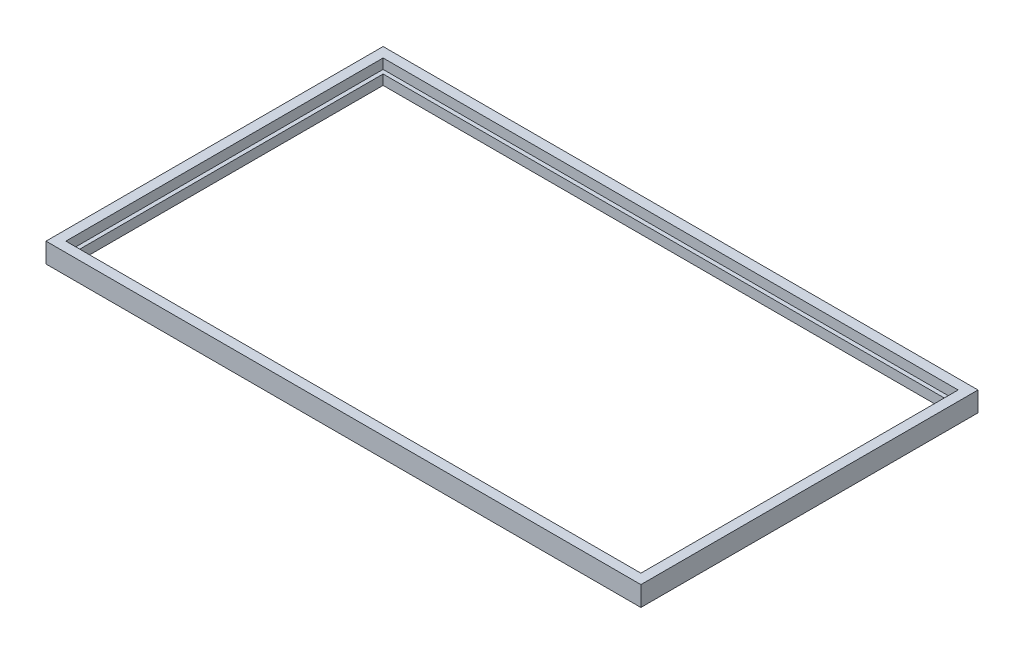
ISO-10303-21;
HEADER;
FILE_DESCRIPTION(('STEP AP214'),'2;1');
FILE_NAME('part.step','',(''),(''),'','','');
FILE_SCHEMA(('AUTOMOTIVE_DESIGN { 1 0 10303 214 1 1 1 1 }'));
ENDSEC;
DATA;
#1=APPLICATION_CONTEXT('core data for automotive mechanical design processes');
#2=APPLICATION_PROTOCOL_DEFINITION('international standard','automotive_design',2000,#1);
#3=PRODUCT_CONTEXT('',#1,'mechanical');
#4=PRODUCT('Part','Part','',(#3));
#5=PRODUCT_RELATED_PRODUCT_CATEGORY('part','',(#4));
#6=PRODUCT_DEFINITION_FORMATION('','',#4);
#7=PRODUCT_DEFINITION_CONTEXT('part definition',#1,'design');
#8=PRODUCT_DEFINITION('design','',#6,#7);
#9=PRODUCT_DEFINITION_SHAPE('','',#8);
#10=(LENGTH_UNIT() NAMED_UNIT(*) SI_UNIT(.MILLI.,.METRE.));
#11=(NAMED_UNIT(*) PLANE_ANGLE_UNIT() SI_UNIT($,.RADIAN.));
#12=(NAMED_UNIT(*) SI_UNIT($,.STERADIAN.) SOLID_ANGLE_UNIT());
#13=UNCERTAINTY_MEASURE_WITH_UNIT(LENGTH_MEASURE(1.E-05),#10,'distance_accuracy_value','');
#14=(GEOMETRIC_REPRESENTATION_CONTEXT(3) GLOBAL_UNCERTAINTY_ASSIGNED_CONTEXT((#13)) GLOBAL_UNIT_ASSIGNED_CONTEXT((#10,
#11,#12)) REPRESENTATION_CONTEXT('',''));
#15=CARTESIAN_POINT('',(0.,0.,0.));
#16=DIRECTION('',(0.,0.,1.));
#17=DIRECTION('',(1.,0.,0.));
#18=AXIS2_PLACEMENT_3D('',#15,#16,#17);
#19=CARTESIAN_POINT('',(0.,0.,0.));
#20=DIRECTION('',(0.,1.,0.));
#21=DIRECTION('',(0.,0.,1.));
#22=AXIS2_PLACEMENT_3D('',#19,#20,#21);
#23=PLANE('',#22);
#24=DIRECTION('',(0.,0.,1.));
#25=VECTOR('',#24,1.);
#26=CARTESIAN_POINT('',(-160.575275384982,0.,-72.0127204845541));
#27=LINE('',#26,#25);
#28=CARTESIAN_POINT('',(-160.575275384982,0.,-72.0127204845541));
#29=VERTEX_POINT('',#28);
#30=CARTESIAN_POINT('',(-160.575275384982,0.,97.9872795154459));
#31=VERTEX_POINT('',#30);
#32=EDGE_CURVE('E189',#29,#31,#27,.T.);
#33=ORIENTED_EDGE('',*,*,#32,.F.);
#34=DIRECTION('',(-1.,0.,0.));
#35=VECTOR('',#34,1.);
#36=CARTESIAN_POINT('',(-160.575275384982,0.,-72.0127204845541));
#37=LINE('',#36,#35);
#38=CARTESIAN_POINT('',(139.424724615018,0.,-72.0127204845541));
#39=VERTEX_POINT('',#38);
#40=EDGE_CURVE('E199',#39,#29,#37,.T.);
#41=ORIENTED_EDGE('',*,*,#40,.F.);
#42=DIRECTION('',(0.,0.,-1.));
#43=VECTOR('',#42,1.);
#44=CARTESIAN_POINT('',(139.424724615018,0.,-72.0127204845541));
#45=LINE('',#44,#43);
#46=CARTESIAN_POINT('',(139.424724615018,0.,97.9872795154459));
#47=VERTEX_POINT('',#46);
#48=EDGE_CURVE('E210',#47,#39,#45,.T.);
#49=ORIENTED_EDGE('',*,*,#48,.F.);
#50=DIRECTION('',(1.,0.,0.));
#51=VECTOR('',#50,1.);
#52=CARTESIAN_POINT('',(-160.575275384982,0.,97.9872795154459));
#53=LINE('',#52,#51);
#54=EDGE_CURVE('E208',#31,#47,#53,.T.);
#55=ORIENTED_EDGE('',*,*,#54,.F.);
#56=EDGE_LOOP('',(#33,#41,#49,#55));
#57=FACE_BOUND('',#56,.T.);
#58=DIRECTION('',(0.,0.,-1.));
#59=VECTOR('',#58,1.);
#60=CARTESIAN_POINT('',(-153.575275384982,0.,0.));
#61=LINE('',#60,#59);
#62=CARTESIAN_POINT('',(-153.575275384982,0.,90.9872795154459));
#63=VERTEX_POINT('',#62);
#64=CARTESIAN_POINT('',(-153.575275384982,0.,-65.0127204845541));
#65=VERTEX_POINT('',#64);
#66=EDGE_CURVE('E152',#63,#65,#61,.T.);
#67=ORIENTED_EDGE('',*,*,#66,.F.);
#68=DIRECTION('',(-1.,0.,0.));
#69=VECTOR('',#68,1.);
#70=CARTESIAN_POINT('',(0.,0.,90.9872795154459));
#71=LINE('',#70,#69);
#72=CARTESIAN_POINT('',(132.424724615018,0.,90.9872795154459));
#73=VERTEX_POINT('',#72);
#74=EDGE_CURVE('E150',#73,#63,#71,.T.);
#75=ORIENTED_EDGE('',*,*,#74,.F.);
#76=DIRECTION('',(0.,0.,1.));
#77=VECTOR('',#76,1.);
#78=CARTESIAN_POINT('',(132.424724615018,0.,0.));
#79=LINE('',#78,#77);
#80=CARTESIAN_POINT('',(132.424724615018,0.,-65.0127204845541));
#81=VERTEX_POINT('',#80);
#82=EDGE_CURVE('E137',#81,#73,#79,.T.);
#83=ORIENTED_EDGE('',*,*,#82,.F.);
#84=DIRECTION('',(1.,0.,0.));
#85=VECTOR('',#84,1.);
#86=CARTESIAN_POINT('',(0.,0.,-65.0127204845541));
#87=LINE('',#86,#85);
#88=EDGE_CURVE('E129',#65,#81,#87,.T.);
#89=ORIENTED_EDGE('',*,*,#88,.F.);
#90=EDGE_LOOP('',(#67,#75,#83,#89));
#91=FACE_BOUND('',#90,.T.);
#92=ADVANCED_FACE('F42',(#57,#91),#23,.F.);
#93=CARTESIAN_POINT('',(-160.575275384982,10.,-72.0127204845541));
#94=DIRECTION('',(1.,0.,0.));
#95=DIRECTION('',(0.,0.,-1.));
#96=AXIS2_PLACEMENT_3D('',#93,#94,#95);
#97=PLANE('',#96);
#98=ORIENTED_EDGE('',*,*,#32,.T.);
#99=DIRECTION('',(0.,-1.,0.));
#100=VECTOR('',#99,1.);
#101=CARTESIAN_POINT('',(-160.575275384982,10.,97.9872795154459));
#102=LINE('',#101,#100);
#103=CARTESIAN_POINT('',(-160.575275384982,10.,97.9872795154459));
#104=VERTEX_POINT('',#103);
#105=EDGE_CURVE('E11',#104,#31,#102,.T.);
#106=ORIENTED_EDGE('',*,*,#105,.F.);
#107=DIRECTION('',(0.,0.,1.));
#108=VECTOR('',#107,1.);
#109=CARTESIAN_POINT('',(-160.575275384982,10.,-72.0127204845541));
#110=LINE('',#109,#108);
#111=CARTESIAN_POINT('',(-160.575275384982,10.,-72.0127204845541));
#112=VERTEX_POINT('',#111);
#113=EDGE_CURVE('E195',#112,#104,#110,.T.);
#114=ORIENTED_EDGE('',*,*,#113,.F.);
#115=DIRECTION('',(0.,-1.,0.));
#116=VECTOR('',#115,1.);
#117=CARTESIAN_POINT('',(-160.575275384982,10.,-72.0127204845541));
#118=LINE('',#117,#116);
#119=EDGE_CURVE('E205',#112,#29,#118,.T.);
#120=ORIENTED_EDGE('',*,*,#119,.T.);
#121=EDGE_LOOP('',(#98,#106,#114,#120));
#122=FACE_BOUND('',#121,.T.);
#123=ADVANCED_FACE('F44',(#122),#97,.F.);
#124=CARTESIAN_POINT('',(-160.575275384982,10.,97.9872795154459));
#125=DIRECTION('',(0.,0.,-1.));
#126=DIRECTION('',(-1.,0.,0.));
#127=AXIS2_PLACEMENT_3D('',#124,#125,#126);
#128=PLANE('',#127);
#129=ORIENTED_EDGE('',*,*,#54,.T.);
#130=DIRECTION('',(0.,-1.,0.));
#131=VECTOR('',#130,1.);
#132=CARTESIAN_POINT('',(139.424724615018,10.,97.9872795154459));
#133=LINE('',#132,#131);
#134=CARTESIAN_POINT('',(139.424724615018,10.,97.9872795154459));
#135=VERTEX_POINT('',#134);
#136=EDGE_CURVE('E50',#135,#47,#133,.T.);
#137=ORIENTED_EDGE('',*,*,#136,.F.);
#138=DIRECTION('',(1.,0.,0.));
#139=VECTOR('',#138,1.);
#140=CARTESIAN_POINT('',(-160.575275384982,10.,97.9872795154459));
#141=LINE('',#140,#139);
#142=EDGE_CURVE('E198',#104,#135,#141,.T.);
#143=ORIENTED_EDGE('',*,*,#142,.F.);
#144=ORIENTED_EDGE('',*,*,#105,.T.);
#145=EDGE_LOOP('',(#129,#137,#143,#144));
#146=FACE_BOUND('',#145,.T.);
#147=ADVANCED_FACE('F237',(#146),#128,.F.);
#148=CARTESIAN_POINT('',(139.424724615018,10.,-72.0127204845541));
#149=DIRECTION('',(-1.,0.,0.));
#150=DIRECTION('',(0.,0.,1.));
#151=AXIS2_PLACEMENT_3D('',#148,#149,#150);
#152=PLANE('',#151);
#153=ORIENTED_EDGE('',*,*,#48,.T.);
#154=DIRECTION('',(0.,-1.,0.));
#155=VECTOR('',#154,1.);
#156=CARTESIAN_POINT('',(139.424724615018,10.,-72.0127204845541));
#157=LINE('',#156,#155);
#158=CARTESIAN_POINT('',(139.424724615018,10.,-72.0127204845541));
#159=VERTEX_POINT('',#158);
#160=EDGE_CURVE('E215',#159,#39,#157,.T.);
#161=ORIENTED_EDGE('',*,*,#160,.F.);
#162=DIRECTION('',(0.,0.,-1.));
#163=VECTOR('',#162,1.);
#164=CARTESIAN_POINT('',(139.424724615018,10.,-72.0127204845541));
#165=LINE('',#164,#163);
#166=EDGE_CURVE('E201',#135,#159,#165,.T.);
#167=ORIENTED_EDGE('',*,*,#166,.F.);
#168=ORIENTED_EDGE('',*,*,#136,.T.);
#169=EDGE_LOOP('',(#153,#161,#167,#168));
#170=FACE_BOUND('',#169,.T.);
#171=ADVANCED_FACE('F222',(#170),#152,.F.);
#172=CARTESIAN_POINT('',(-160.575275384982,10.,-72.0127204845541));
#173=DIRECTION('',(0.,0.,1.));
#174=DIRECTION('',(1.,0.,0.));
#175=AXIS2_PLACEMENT_3D('',#172,#173,#174);
#176=PLANE('',#175);
#177=ORIENTED_EDGE('',*,*,#40,.T.);
#178=ORIENTED_EDGE('',*,*,#119,.F.);
#179=DIRECTION('',(-1.,0.,0.));
#180=VECTOR('',#179,1.);
#181=CARTESIAN_POINT('',(-160.575275384982,10.,-72.0127204845541));
#182=LINE('',#181,#180);
#183=EDGE_CURVE('E203',#159,#112,#182,.T.);
#184=ORIENTED_EDGE('',*,*,#183,.F.);
#185=ORIENTED_EDGE('',*,*,#160,.T.);
#186=EDGE_LOOP('',(#177,#178,#184,#185));
#187=FACE_BOUND('',#186,.T.);
#188=ADVANCED_FACE('F230',(#187),#176,.F.);
#189=CARTESIAN_POINT('',(0.,10.,0.));
#190=DIRECTION('',(0.,1.,0.));
#191=DIRECTION('',(0.,0.,1.));
#192=AXIS2_PLACEMENT_3D('',#189,#190,#191);
#193=PLANE('',#192);
#194=DIRECTION('',(0.,0.,1.));
#195=VECTOR('',#194,1.);
#196=CARTESIAN_POINT('',(-155.575275384982,10.,-67.0127204845541));
#197=LINE('',#196,#195);
#198=CARTESIAN_POINT('',(-155.575275384982,10.,-67.0127204845541));
#199=VERTEX_POINT('',#198);
#200=CARTESIAN_POINT('',(-155.575275384982,10.,92.9872795154459));
#201=VERTEX_POINT('',#200);
#202=EDGE_CURVE('E65',#199,#201,#197,.T.);
#203=ORIENTED_EDGE('',*,*,#202,.F.);
#204=DIRECTION('',(-1.,0.,0.));
#205=VECTOR('',#204,1.);
#206=CARTESIAN_POINT('',(-155.575275384982,10.,-67.0127204845541));
#207=LINE('',#206,#205);
#208=CARTESIAN_POINT('',(134.424724615018,10.,-67.0127204845541));
#209=VERTEX_POINT('',#208);
#210=EDGE_CURVE('E168',#209,#199,#207,.T.);
#211=ORIENTED_EDGE('',*,*,#210,.F.);
#212=DIRECTION('',(0.,0.,-1.));
#213=VECTOR('',#212,1.);
#214=CARTESIAN_POINT('',(134.424724615018,10.,-67.0127204845541));
#215=LINE('',#214,#213);
#216=CARTESIAN_POINT('',(134.424724615018,10.,92.9872795154459));
#217=VERTEX_POINT('',#216);
#218=EDGE_CURVE('E182',#217,#209,#215,.T.);
#219=ORIENTED_EDGE('',*,*,#218,.F.);
#220=DIRECTION('',(1.,0.,0.));
#221=VECTOR('',#220,1.);
#222=CARTESIAN_POINT('',(-155.575275384982,10.,92.9872795154459));
#223=LINE('',#222,#221);
#224=EDGE_CURVE('E179',#201,#217,#223,.T.);
#225=ORIENTED_EDGE('',*,*,#224,.F.);
#226=EDGE_LOOP('',(#203,#211,#219,#225));
#227=FACE_BOUND('',#226,.T.);
#228=ORIENTED_EDGE('',*,*,#113,.T.);
#229=ORIENTED_EDGE('',*,*,#142,.T.);
#230=ORIENTED_EDGE('',*,*,#166,.T.);
#231=ORIENTED_EDGE('',*,*,#183,.T.);
#232=EDGE_LOOP('',(#228,#229,#230,#231));
#233=FACE_BOUND('',#232,.T.);
#234=ADVANCED_FACE('F236',(#227,#233),#193,.T.);
#235=CARTESIAN_POINT('',(-155.575275384982,5.,-67.0127204845541));
#236=DIRECTION('',(-1.,0.,0.));
#237=DIRECTION('',(0.,0.,1.));
#238=AXIS2_PLACEMENT_3D('',#235,#236,#237);
#239=PLANE('',#238);
#240=ORIENTED_EDGE('',*,*,#202,.T.);
#241=DIRECTION('',(0.,1.,0.));
#242=VECTOR('',#241,1.);
#243=CARTESIAN_POINT('',(-155.575275384982,5.,92.9872795154459));
#244=LINE('',#243,#242);
#245=CARTESIAN_POINT('',(-155.575275384982,5.,92.9872795154459));
#246=VERTEX_POINT('',#245);
#247=EDGE_CURVE('E177',#246,#201,#244,.T.);
#248=ORIENTED_EDGE('',*,*,#247,.F.);
#249=DIRECTION('',(0.,0.,1.));
#250=VECTOR('',#249,1.);
#251=CARTESIAN_POINT('',(-155.575275384982,5.,-67.0127204845541));
#252=LINE('',#251,#250);
#253=CARTESIAN_POINT('',(-155.575275384982,5.,-67.0127204845541));
#254=VERTEX_POINT('',#253);
#255=EDGE_CURVE('E164',#254,#246,#252,.T.);
#256=ORIENTED_EDGE('',*,*,#255,.F.);
#257=DIRECTION('',(0.,1.,0.));
#258=VECTOR('',#257,1.);
#259=CARTESIAN_POINT('',(-155.575275384982,5.,-67.0127204845541));
#260=LINE('',#259,#258);
#261=EDGE_CURVE('E187',#254,#199,#260,.T.);
#262=ORIENTED_EDGE('',*,*,#261,.T.);
#263=EDGE_LOOP('',(#240,#248,#256,#262));
#264=FACE_BOUND('',#263,.T.);
#265=ADVANCED_FACE('F257',(#264),#239,.F.);
#266=CARTESIAN_POINT('',(-155.575275384982,5.,-67.0127204845541));
#267=DIRECTION('',(0.,0.,-1.));
#268=DIRECTION('',(-1.,0.,0.));
#269=AXIS2_PLACEMENT_3D('',#266,#267,#268);
#270=PLANE('',#269);
#271=ORIENTED_EDGE('',*,*,#210,.T.);
#272=ORIENTED_EDGE('',*,*,#261,.F.);
#273=DIRECTION('',(-1.,0.,0.));
#274=VECTOR('',#273,1.);
#275=CARTESIAN_POINT('',(-155.575275384982,5.,-67.0127204845541));
#276=LINE('',#275,#274);
#277=CARTESIAN_POINT('',(134.424724615018,5.,-67.0127204845541));
#278=VERTEX_POINT('',#277);
#279=EDGE_CURVE('E174',#278,#254,#276,.T.);
#280=ORIENTED_EDGE('',*,*,#279,.F.);
#281=DIRECTION('',(0.,1.,0.));
#282=VECTOR('',#281,1.);
#283=CARTESIAN_POINT('',(134.424724615018,5.,-67.0127204845541));
#284=LINE('',#283,#282);
#285=EDGE_CURVE('E190',#278,#209,#284,.T.);
#286=ORIENTED_EDGE('',*,*,#285,.T.);
#287=EDGE_LOOP('',(#271,#272,#280,#286));
#288=FACE_BOUND('',#287,.T.);
#289=ADVANCED_FACE('F262',(#288),#270,.F.);
#290=CARTESIAN_POINT('',(134.424724615018,5.,-67.0127204845541));
#291=DIRECTION('',(1.,0.,0.));
#292=DIRECTION('',(0.,0.,-1.));
#293=AXIS2_PLACEMENT_3D('',#290,#291,#292);
#294=PLANE('',#293);
#295=ORIENTED_EDGE('',*,*,#218,.T.);
#296=ORIENTED_EDGE('',*,*,#285,.F.);
#297=DIRECTION('',(0.,0.,-1.));
#298=VECTOR('',#297,1.);
#299=CARTESIAN_POINT('',(134.424724615018,5.,-67.0127204845541));
#300=LINE('',#299,#298);
#301=CARTESIAN_POINT('',(134.424724615018,5.,92.9872795154459));
#302=VERTEX_POINT('',#301);
#303=EDGE_CURVE('E171',#302,#278,#300,.T.);
#304=ORIENTED_EDGE('',*,*,#303,.F.);
#305=DIRECTION('',(0.,1.,0.));
#306=VECTOR('',#305,1.);
#307=CARTESIAN_POINT('',(134.424724615018,5.,92.9872795154459));
#308=LINE('',#307,#306);
#309=EDGE_CURVE('E192',#302,#217,#308,.T.);
#310=ORIENTED_EDGE('',*,*,#309,.T.);
#311=EDGE_LOOP('',(#295,#296,#304,#310));
#312=FACE_BOUND('',#311,.T.);
#313=ADVANCED_FACE('F276',(#312),#294,.F.);
#314=CARTESIAN_POINT('',(-155.575275384982,5.,92.9872795154459));
#315=DIRECTION('',(0.,0.,1.));
#316=DIRECTION('',(1.,0.,0.));
#317=AXIS2_PLACEMENT_3D('',#314,#315,#316);
#318=PLANE('',#317);
#319=ORIENTED_EDGE('',*,*,#224,.T.);
#320=ORIENTED_EDGE('',*,*,#309,.F.);
#321=DIRECTION('',(1.,0.,0.));
#322=VECTOR('',#321,1.);
#323=CARTESIAN_POINT('',(-155.575275384982,5.,92.9872795154459));
#324=LINE('',#323,#322);
#325=EDGE_CURVE('E167',#246,#302,#324,.T.);
#326=ORIENTED_EDGE('',*,*,#325,.F.);
#327=ORIENTED_EDGE('',*,*,#247,.T.);
#328=EDGE_LOOP('',(#319,#320,#326,#327));
#329=FACE_BOUND('',#328,.T.);
#330=ADVANCED_FACE('F267',(#329),#318,.F.);
#331=CARTESIAN_POINT('',(0.,5.,0.));
#332=DIRECTION('',(0.,1.,0.));
#333=DIRECTION('',(0.,0.,1.));
#334=AXIS2_PLACEMENT_3D('',#331,#332,#333);
#335=PLANE('',#334);
#336=DIRECTION('',(-1.,0.,0.));
#337=VECTOR('',#336,1.);
#338=CARTESIAN_POINT('',(-153.575275384982,5.,-65.0127204845541));
#339=LINE('',#338,#337);
#340=CARTESIAN_POINT('',(132.424724615018,5.,-65.0127204845541));
#341=VERTEX_POINT('',#340);
#342=CARTESIAN_POINT('',(-153.575275384982,5.,-65.0127204845541));
#343=VERTEX_POINT('',#342);
#344=EDGE_CURVE('E162',#341,#343,#339,.T.);
#345=ORIENTED_EDGE('',*,*,#344,.F.);
#346=DIRECTION('',(0.,0.,-1.));
#347=VECTOR('',#346,1.);
#348=CARTESIAN_POINT('',(132.424724615018,5.,-65.0127204845541));
#349=LINE('',#348,#347);
#350=CARTESIAN_POINT('',(132.424724615018,5.,90.9872795154459));
#351=VERTEX_POINT('',#350);
#352=EDGE_CURVE('E145',#351,#341,#349,.T.);
#353=ORIENTED_EDGE('',*,*,#352,.F.);
#354=DIRECTION('',(1.,0.,0.));
#355=VECTOR('',#354,1.);
#356=CARTESIAN_POINT('',(-153.575275384982,5.,90.9872795154459));
#357=LINE('',#356,#355);
#358=CARTESIAN_POINT('',(-153.575275384982,5.,90.9872795154459));
#359=VERTEX_POINT('',#358);
#360=EDGE_CURVE('E159',#359,#351,#357,.T.);
#361=ORIENTED_EDGE('',*,*,#360,.F.);
#362=DIRECTION('',(0.,0.,1.));
#363=VECTOR('',#362,1.);
#364=CARTESIAN_POINT('',(-153.575275384982,5.,-65.0127204845541));
#365=LINE('',#364,#363);
#366=EDGE_CURVE('E157',#343,#359,#365,.T.);
#367=ORIENTED_EDGE('',*,*,#366,.F.);
#368=EDGE_LOOP('',(#345,#353,#361,#367));
#369=FACE_BOUND('',#368,.T.);
#370=ORIENTED_EDGE('',*,*,#255,.T.);
#371=ORIENTED_EDGE('',*,*,#325,.T.);
#372=ORIENTED_EDGE('',*,*,#303,.T.);
#373=ORIENTED_EDGE('',*,*,#279,.T.);
#374=EDGE_LOOP('',(#370,#371,#372,#373));
#375=FACE_BOUND('',#374,.T.);
#376=ADVANCED_FACE('F273',(#369,#375),#335,.T.);
#377=CARTESIAN_POINT('',(-153.575275384982,38.,-65.0127204845541));
#378=DIRECTION('',(1.,0.,0.));
#379=DIRECTION('',(0.,0.,-1.));
#380=AXIS2_PLACEMENT_3D('',#377,#378,#379);
#381=PLANE('',#380);
#382=ORIENTED_EDGE('',*,*,#66,.T.);
#383=DIRECTION('',(0.,-1.,0.));
#384=VECTOR('',#383,1.);
#385=CARTESIAN_POINT('',(-153.575275384982,38.,-65.0127204845541));
#386=LINE('',#385,#384);
#387=EDGE_CURVE('E57',#343,#65,#386,.T.);
#388=ORIENTED_EDGE('',*,*,#387,.F.);
#389=ORIENTED_EDGE('',*,*,#366,.T.);
#390=DIRECTION('',(0.,-1.,0.));
#391=VECTOR('',#390,1.);
#392=CARTESIAN_POINT('',(-153.575275384982,38.,90.9872795154459));
#393=LINE('',#392,#391);
#394=EDGE_CURVE('E138',#359,#63,#393,.T.);
#395=ORIENTED_EDGE('',*,*,#394,.T.);
#396=EDGE_LOOP('',(#382,#388,#389,#395));
#397=FACE_BOUND('',#396,.T.);
#398=ADVANCED_FACE('F286',(#397),#381,.T.);
#399=CARTESIAN_POINT('',(-153.575275384982,38.,90.9872795154459));
#400=DIRECTION('',(0.,0.,-1.));
#401=DIRECTION('',(-1.,0.,0.));
#402=AXIS2_PLACEMENT_3D('',#399,#400,#401);
#403=PLANE('',#402);
#404=ORIENTED_EDGE('',*,*,#74,.T.);
#405=ORIENTED_EDGE('',*,*,#394,.F.);
#406=ORIENTED_EDGE('',*,*,#360,.T.);
#407=DIRECTION('',(0.,-1.,0.));
#408=VECTOR('',#407,1.);
#409=CARTESIAN_POINT('',(132.424724615018,38.,90.9872795154459));
#410=LINE('',#409,#408);
#411=EDGE_CURVE('E147',#351,#73,#410,.T.);
#412=ORIENTED_EDGE('',*,*,#411,.T.);
#413=EDGE_LOOP('',(#404,#405,#406,#412));
#414=FACE_BOUND('',#413,.T.);
#415=ADVANCED_FACE('F290',(#414),#403,.T.);
#416=CARTESIAN_POINT('',(132.424724615018,38.,-65.0127204845541));
#417=DIRECTION('',(-1.,0.,0.));
#418=DIRECTION('',(0.,0.,1.));
#419=AXIS2_PLACEMENT_3D('',#416,#417,#418);
#420=PLANE('',#419);
#421=ORIENTED_EDGE('',*,*,#82,.T.);
#422=ORIENTED_EDGE('',*,*,#411,.F.);
#423=ORIENTED_EDGE('',*,*,#352,.T.);
#424=DIRECTION('',(0.,-1.,0.));
#425=VECTOR('',#424,1.);
#426=CARTESIAN_POINT('',(132.424724615018,38.,-65.0127204845541));
#427=LINE('',#426,#425);
#428=EDGE_CURVE('E132',#341,#81,#427,.T.);
#429=ORIENTED_EDGE('',*,*,#428,.T.);
#430=EDGE_LOOP('',(#421,#422,#423,#429));
#431=FACE_BOUND('',#430,.T.);
#432=ADVANCED_FACE('F141',(#431),#420,.T.);
#433=CARTESIAN_POINT('',(-153.575275384982,38.,-65.0127204845541));
#434=DIRECTION('',(0.,0.,1.));
#435=DIRECTION('',(1.,0.,0.));
#436=AXIS2_PLACEMENT_3D('',#433,#434,#435);
#437=PLANE('',#436);
#438=ORIENTED_EDGE('',*,*,#88,.T.);
#439=ORIENTED_EDGE('',*,*,#428,.F.);
#440=ORIENTED_EDGE('',*,*,#344,.T.);
#441=ORIENTED_EDGE('',*,*,#387,.T.);
#442=EDGE_LOOP('',(#438,#439,#440,#441));
#443=FACE_BOUND('',#442,.T.);
#444=ADVANCED_FACE('F131',(#443),#437,.T.);
#445=CLOSED_SHELL('',(#92,#123,#147,#171,#188,#234,#265,#289,#313,#330,#376,#398,#415,#432,#444));
#446=MANIFOLD_SOLID_BREP('B2',#445);
#447=ADVANCED_BREP_SHAPE_REPRESENTATION('',(#18,#446),#14);
#448=SHAPE_DEFINITION_REPRESENTATION(#9,#447);
ENDSEC;
END-ISO-10303-21;
